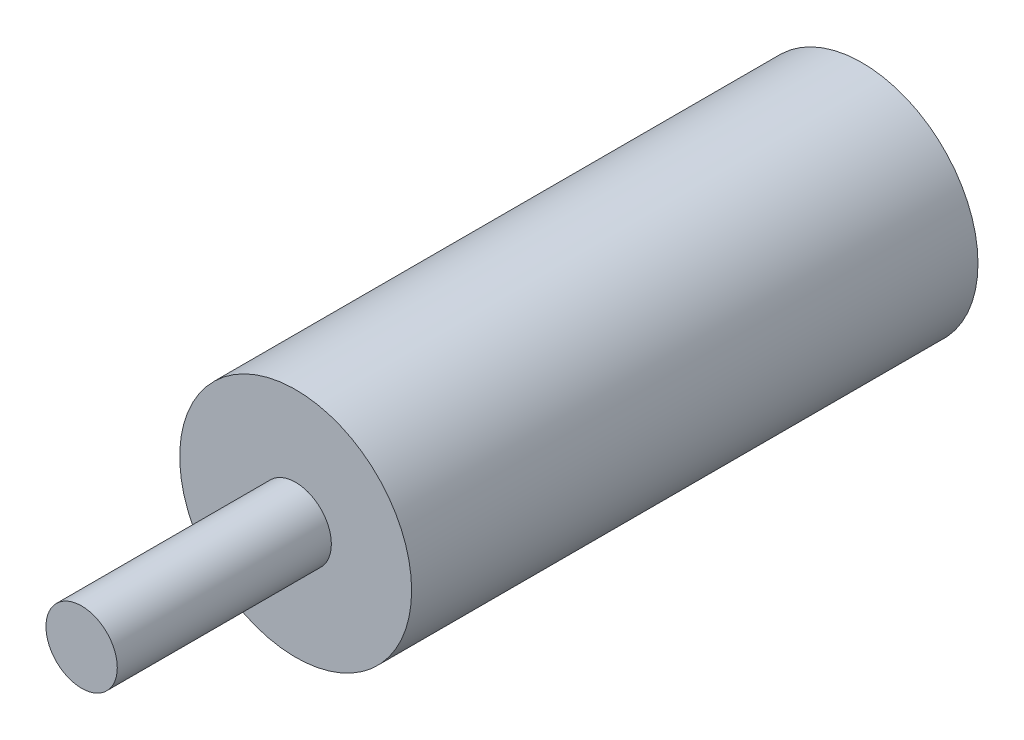
ISO-10303-21;
HEADER;
FILE_DESCRIPTION(('STEP AP214'),'2;1');
FILE_NAME('part.step','',(''),(''),'','','');
FILE_SCHEMA(('AUTOMOTIVE_DESIGN { 1 0 10303 214 1 1 1 1 }'));
ENDSEC;
DATA;
#1=APPLICATION_CONTEXT('core data for automotive mechanical design processes');
#2=APPLICATION_PROTOCOL_DEFINITION('international standard','automotive_design',2000,#1);
#3=PRODUCT_CONTEXT('',#1,'mechanical');
#4=PRODUCT('Part','Part','',(#3));
#5=PRODUCT_RELATED_PRODUCT_CATEGORY('part','',(#4));
#6=PRODUCT_DEFINITION_FORMATION('','',#4);
#7=PRODUCT_DEFINITION_CONTEXT('part definition',#1,'design');
#8=PRODUCT_DEFINITION('design','',#6,#7);
#9=PRODUCT_DEFINITION_SHAPE('','',#8);
#10=(LENGTH_UNIT() NAMED_UNIT(*) SI_UNIT(.MILLI.,.METRE.));
#11=(NAMED_UNIT(*) PLANE_ANGLE_UNIT() SI_UNIT($,.RADIAN.));
#12=(NAMED_UNIT(*) SI_UNIT($,.STERADIAN.) SOLID_ANGLE_UNIT());
#13=UNCERTAINTY_MEASURE_WITH_UNIT(LENGTH_MEASURE(1.E-05),#10,'distance_accuracy_value','');
#14=(GEOMETRIC_REPRESENTATION_CONTEXT(3) GLOBAL_UNCERTAINTY_ASSIGNED_CONTEXT((#13)) GLOBAL_UNIT_ASSIGNED_CONTEXT((#10,
#11,#12)) REPRESENTATION_CONTEXT('',''));
#15=CARTESIAN_POINT('',(0.,0.,0.));
#16=DIRECTION('',(0.,0.,1.));
#17=DIRECTION('',(1.,0.,0.));
#18=AXIS2_PLACEMENT_3D('',#15,#16,#17);
#19=CARTESIAN_POINT('',(0.,0.,127.));
#20=DIRECTION('',(0.,0.,-1.));
#21=DIRECTION('',(-1.,0.,0.));
#22=AXIS2_PLACEMENT_3D('',#19,#20,#21);
#23=CYLINDRICAL_SURFACE('',#22,26.);
#24=CARTESIAN_POINT('',(0.,0.,127.));
#25=DIRECTION('',(0.,0.,1.));
#26=DIRECTION('',(1.,0.,0.));
#27=AXIS2_PLACEMENT_3D('',#24,#25,#26);
#28=CIRCLE('',#27,26.);
#29=CARTESIAN_POINT('',(26.,0.,127.));
#30=VERTEX_POINT('',#29);
#31=EDGE_CURVE('E10',#30,#30,#28,.T.);
#32=ORIENTED_EDGE('',*,*,#31,.F.);
#33=EDGE_LOOP('',(#32));
#34=FACE_BOUND('',#33,.T.);
#35=CARTESIAN_POINT('',(0.,0.,0.));
#36=DIRECTION('',(0.,0.,1.));
#37=DIRECTION('',(1.,0.,0.));
#38=AXIS2_PLACEMENT_3D('',#35,#36,#37);
#39=CIRCLE('',#38,26.);
#40=CARTESIAN_POINT('',(26.,0.,0.));
#41=VERTEX_POINT('',#40);
#42=EDGE_CURVE('E33',#41,#41,#39,.T.);
#43=ORIENTED_EDGE('',*,*,#42,.T.);
#44=EDGE_LOOP('',(#43));
#45=FACE_BOUND('',#44,.T.);
#46=ADVANCED_FACE('F30',(#34,#45),#23,.T.);
#47=CARTESIAN_POINT('',(0.,0.,127.));
#48=DIRECTION('',(0.,0.,1.));
#49=DIRECTION('',(1.,0.,0.));
#50=AXIS2_PLACEMENT_3D('',#47,#48,#49);
#51=PLANE('',#50);
#52=CARTESIAN_POINT('',(0.,0.,127.));
#53=DIRECTION('',(0.,0.,1.));
#54=DIRECTION('',(1.,0.,0.));
#55=AXIS2_PLACEMENT_3D('',#52,#53,#54);
#56=CIRCLE('',#55,8.);
#57=CARTESIAN_POINT('',(8.,0.,127.));
#58=VERTEX_POINT('',#57);
#59=EDGE_CURVE('E37',#58,#58,#56,.T.);
#60=ORIENTED_EDGE('',*,*,#59,.F.);
#61=EDGE_LOOP('',(#60));
#62=FACE_BOUND('',#61,.T.);
#63=ORIENTED_EDGE('',*,*,#31,.T.);
#64=EDGE_LOOP('',(#63));
#65=FACE_BOUND('',#64,.T.);
#66=ADVANCED_FACE('F54',(#62,#65),#51,.T.);
#67=CARTESIAN_POINT('',(0.,0.,0.));
#68=DIRECTION('',(0.,0.,1.));
#69=DIRECTION('',(1.,0.,0.));
#70=AXIS2_PLACEMENT_3D('',#67,#68,#69);
#71=PLANE('',#70);
#72=ORIENTED_EDGE('',*,*,#42,.F.);
#73=EDGE_LOOP('',(#72));
#74=FACE_BOUND('',#73,.T.);
#75=ADVANCED_FACE('F51',(#74),#71,.F.);
#76=CARTESIAN_POINT('',(0.,0.,175.));
#77=DIRECTION('',(0.,0.,-1.));
#78=DIRECTION('',(-1.,0.,0.));
#79=AXIS2_PLACEMENT_3D('',#76,#77,#78);
#80=CYLINDRICAL_SURFACE('',#79,8.);
#81=ORIENTED_EDGE('',*,*,#59,.T.);
#82=EDGE_LOOP('',(#81));
#83=FACE_BOUND('',#82,.T.);
#84=CARTESIAN_POINT('',(0.,0.,175.));
#85=DIRECTION('',(0.,0.,1.));
#86=DIRECTION('',(1.,0.,0.));
#87=AXIS2_PLACEMENT_3D('',#84,#85,#86);
#88=CIRCLE('',#87,8.);
#89=CARTESIAN_POINT('',(8.,0.,175.));
#90=VERTEX_POINT('',#89);
#91=EDGE_CURVE('E43',#90,#90,#88,.T.);
#92=ORIENTED_EDGE('',*,*,#91,.F.);
#93=EDGE_LOOP('',(#92));
#94=FACE_BOUND('',#93,.T.);
#95=ADVANCED_FACE('F53',(#83,#94),#80,.T.);
#96=CARTESIAN_POINT('',(0.,0.,175.));
#97=DIRECTION('',(0.,0.,1.));
#98=DIRECTION('',(1.,0.,0.));
#99=AXIS2_PLACEMENT_3D('',#96,#97,#98);
#100=PLANE('',#99);
#101=ORIENTED_EDGE('',*,*,#91,.T.);
#102=EDGE_LOOP('',(#101));
#103=FACE_BOUND('',#102,.T.);
#104=ADVANCED_FACE('F59',(#103),#100,.T.);
#105=CLOSED_SHELL('',(#46,#66,#75,#95,#104));
#106=MANIFOLD_SOLID_BREP('B2',#105);
#107=ADVANCED_BREP_SHAPE_REPRESENTATION('',(#18,#106),#14);
#108=SHAPE_DEFINITION_REPRESENTATION(#9,#107);
ENDSEC;
END-ISO-10303-21;
